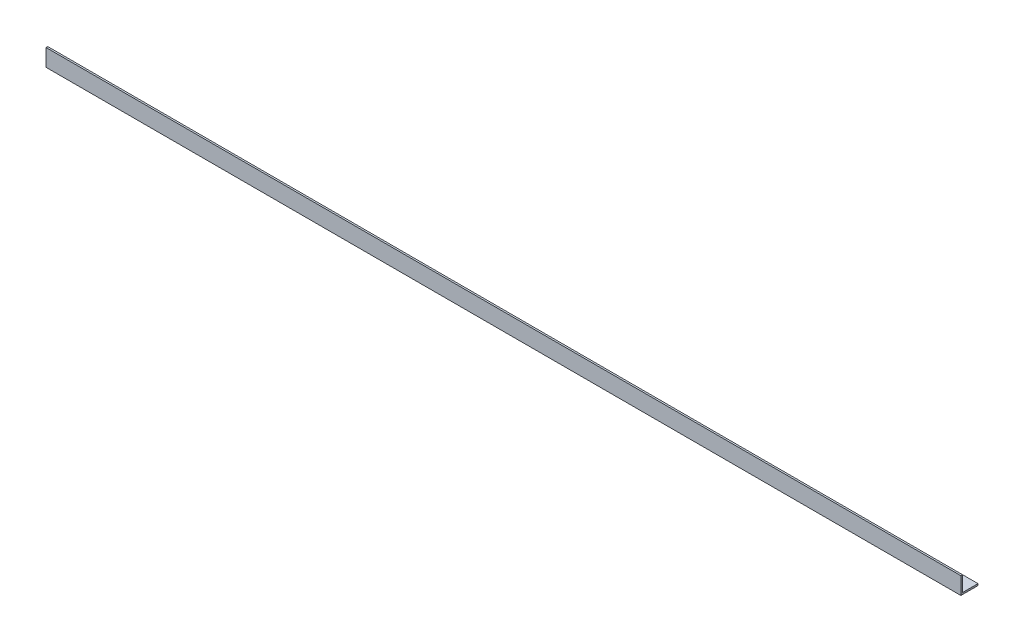
ISO-10303-21;
HEADER;
FILE_DESCRIPTION(('STEP AP214'),'2;1');
FILE_NAME('part.step','',(''),(''),'','','');
FILE_SCHEMA(('AUTOMOTIVE_DESIGN { 1 0 10303 214 1 1 1 1 }'));
ENDSEC;
DATA;
#1=APPLICATION_CONTEXT('core data for automotive mechanical design processes');
#2=APPLICATION_PROTOCOL_DEFINITION('international standard','automotive_design',2000,#1);
#3=PRODUCT_CONTEXT('',#1,'mechanical');
#4=PRODUCT('Part','Part','',(#3));
#5=PRODUCT_RELATED_PRODUCT_CATEGORY('part','',(#4));
#6=PRODUCT_DEFINITION_FORMATION('','',#4);
#7=PRODUCT_DEFINITION_CONTEXT('part definition',#1,'design');
#8=PRODUCT_DEFINITION('design','',#6,#7);
#9=PRODUCT_DEFINITION_SHAPE('','',#8);
#10=(LENGTH_UNIT() NAMED_UNIT(*) SI_UNIT(.MILLI.,.METRE.));
#11=(NAMED_UNIT(*) PLANE_ANGLE_UNIT() SI_UNIT($,.RADIAN.));
#12=(NAMED_UNIT(*) SI_UNIT($,.STERADIAN.) SOLID_ANGLE_UNIT());
#13=UNCERTAINTY_MEASURE_WITH_UNIT(LENGTH_MEASURE(1.E-05),#10,'distance_accuracy_value','');
#14=(GEOMETRIC_REPRESENTATION_CONTEXT(3) GLOBAL_UNCERTAINTY_ASSIGNED_CONTEXT((#13)) GLOBAL_UNIT_ASSIGNED_CONTEXT((#10,
#11,#12)) REPRESENTATION_CONTEXT('',''));
#15=CARTESIAN_POINT('',(0.,0.,0.));
#16=DIRECTION('',(0.,0.,1.));
#17=DIRECTION('',(1.,0.,0.));
#18=AXIS2_PLACEMENT_3D('',#15,#16,#17);
#19=CARTESIAN_POINT('',(2665.,0.,0.));
#20=DIRECTION('',(0.,1.,0.));
#21=DIRECTION('',(0.,0.,1.));
#22=AXIS2_PLACEMENT_3D('',#19,#20,#21);
#23=PLANE('',#22);
#24=DIRECTION('',(0.,0.,-1.));
#25=VECTOR('',#24,1.);
#26=CARTESIAN_POINT('',(0.,0.,0.));
#27=LINE('',#26,#25);
#28=CARTESIAN_POINT('',(0.,0.,0.));
#29=VERTEX_POINT('',#28);
#30=CARTESIAN_POINT('',(0.,0.,-50.));
#31=VERTEX_POINT('',#30);
#32=EDGE_CURVE('E121',#29,#31,#27,.T.);
#33=ORIENTED_EDGE('',*,*,#32,.T.);
#34=DIRECTION('',(-1.,0.,0.));
#35=VECTOR('',#34,1.);
#36=CARTESIAN_POINT('',(2665.,0.,-50.));
#37=LINE('',#36,#35);
#38=CARTESIAN_POINT('',(2665.,0.,-50.));
#39=VERTEX_POINT('',#38);
#40=EDGE_CURVE('E11',#39,#31,#37,.T.);
#41=ORIENTED_EDGE('',*,*,#40,.F.);
#42=DIRECTION('',(0.,0.,-1.));
#43=VECTOR('',#42,1.);
#44=CARTESIAN_POINT('',(2665.,0.,0.));
#45=LINE('',#44,#43);
#46=CARTESIAN_POINT('',(2665.,0.,0.));
#47=VERTEX_POINT('',#46);
#48=EDGE_CURVE('E85',#47,#39,#45,.T.);
#49=ORIENTED_EDGE('',*,*,#48,.F.);
#50=DIRECTION('',(-1.,0.,0.));
#51=VECTOR('',#50,1.);
#52=CARTESIAN_POINT('',(2665.,0.,0.));
#53=LINE('',#52,#51);
#54=EDGE_CURVE('E117',#47,#29,#53,.T.);
#55=ORIENTED_EDGE('',*,*,#54,.T.);
#56=EDGE_LOOP('',(#33,#41,#49,#55));
#57=FACE_BOUND('',#56,.T.);
#58=ADVANCED_FACE('F38',(#57),#23,.F.);
#59=CARTESIAN_POINT('',(2665.,5.,-50.));
#60=DIRECTION('',(0.,0.,-1.));
#61=DIRECTION('',(-1.,0.,0.));
#62=AXIS2_PLACEMENT_3D('',#59,#60,#61);
#63=PLANE('',#62);
#64=DIRECTION('',(0.,-1.,0.));
#65=VECTOR('',#64,1.);
#66=CARTESIAN_POINT('',(0.,5.,-50.));
#67=LINE('',#66,#65);
#68=CARTESIAN_POINT('',(0.,5.,-50.));
#69=VERTEX_POINT('',#68);
#70=EDGE_CURVE('E124',#69,#31,#67,.T.);
#71=ORIENTED_EDGE('',*,*,#70,.F.);
#72=DIRECTION('',(-1.,0.,0.));
#73=VECTOR('',#72,1.);
#74=CARTESIAN_POINT('',(2665.,5.,-50.));
#75=LINE('',#74,#73);
#76=CARTESIAN_POINT('',(2665.,5.,-50.));
#77=VERTEX_POINT('',#76);
#78=EDGE_CURVE('E47',#77,#69,#75,.T.);
#79=ORIENTED_EDGE('',*,*,#78,.F.);
#80=DIRECTION('',(0.,-1.,0.));
#81=VECTOR('',#80,1.);
#82=CARTESIAN_POINT('',(2665.,5.,-50.));
#83=LINE('',#82,#81);
#84=EDGE_CURVE('E216',#77,#39,#83,.T.);
#85=ORIENTED_EDGE('',*,*,#84,.T.);
#86=ORIENTED_EDGE('',*,*,#40,.T.);
#87=EDGE_LOOP('',(#71,#79,#85,#86));
#88=FACE_BOUND('',#87,.T.);
#89=ADVANCED_FACE('F146',(#88),#63,.T.);
#90=CARTESIAN_POINT('',(2665.,5.,0.));
#91=DIRECTION('',(0.,1.,0.));
#92=DIRECTION('',(0.,0.,1.));
#93=AXIS2_PLACEMENT_3D('',#90,#91,#92);
#94=PLANE('',#93);
#95=DIRECTION('',(0.,0.,-1.));
#96=VECTOR('',#95,1.);
#97=CARTESIAN_POINT('',(0.,5.,0.));
#98=LINE('',#97,#96);
#99=CARTESIAN_POINT('',(0.,5.,-5.));
#100=VERTEX_POINT('',#99);
#101=EDGE_CURVE('E127',#100,#69,#98,.T.);
#102=ORIENTED_EDGE('',*,*,#101,.F.);
#103=DIRECTION('',(-1.,0.,0.));
#104=VECTOR('',#103,1.);
#105=CARTESIAN_POINT('',(2665.,5.,-5.));
#106=LINE('',#105,#104);
#107=CARTESIAN_POINT('',(2665.,5.,-5.));
#108=VERTEX_POINT('',#107);
#109=EDGE_CURVE('E107',#108,#100,#106,.T.);
#110=ORIENTED_EDGE('',*,*,#109,.F.);
#111=DIRECTION('',(0.,0.,-1.));
#112=VECTOR('',#111,1.);
#113=CARTESIAN_POINT('',(2665.,5.,0.));
#114=LINE('',#113,#112);
#115=EDGE_CURVE('E113',#108,#77,#114,.T.);
#116=ORIENTED_EDGE('',*,*,#115,.T.);
#117=ORIENTED_EDGE('',*,*,#78,.T.);
#118=EDGE_LOOP('',(#102,#110,#116,#117));
#119=FACE_BOUND('',#118,.T.);
#120=ADVANCED_FACE('F143',(#119),#94,.T.);
#121=CARTESIAN_POINT('',(2665.,50.,-5.));
#122=DIRECTION('',(0.,0.,-1.));
#123=DIRECTION('',(0.,1.,0.));
#124=AXIS2_PLACEMENT_3D('',#121,#122,#123);
#125=PLANE('',#124);
#126=DIRECTION('',(0.,-1.,0.));
#127=VECTOR('',#126,1.);
#128=CARTESIAN_POINT('',(0.,50.,-5.));
#129=LINE('',#128,#127);
#130=CARTESIAN_POINT('',(0.,50.,-5.));
#131=VERTEX_POINT('',#130);
#132=EDGE_CURVE('E101',#131,#100,#129,.T.);
#133=ORIENTED_EDGE('',*,*,#132,.F.);
#134=DIRECTION('',(-1.,0.,0.));
#135=VECTOR('',#134,1.);
#136=CARTESIAN_POINT('',(2665.,50.,-5.));
#137=LINE('',#136,#135);
#138=CARTESIAN_POINT('',(2665.,50.,-5.));
#139=VERTEX_POINT('',#138);
#140=EDGE_CURVE('E96',#139,#131,#137,.T.);
#141=ORIENTED_EDGE('',*,*,#140,.F.);
#142=DIRECTION('',(0.,-1.,0.));
#143=VECTOR('',#142,1.);
#144=CARTESIAN_POINT('',(2665.,50.,-5.));
#145=LINE('',#144,#143);
#146=EDGE_CURVE('E99',#139,#108,#145,.T.);
#147=ORIENTED_EDGE('',*,*,#146,.T.);
#148=ORIENTED_EDGE('',*,*,#109,.T.);
#149=EDGE_LOOP('',(#133,#141,#147,#148));
#150=FACE_BOUND('',#149,.T.);
#151=ADVANCED_FACE('F98',(#150),#125,.T.);
#152=CARTESIAN_POINT('',(2665.,50.,0.));
#153=DIRECTION('',(0.,1.,0.));
#154=DIRECTION('',(0.,0.,1.));
#155=AXIS2_PLACEMENT_3D('',#152,#153,#154);
#156=PLANE('',#155);
#157=DIRECTION('',(0.,0.,-1.));
#158=VECTOR('',#157,1.);
#159=CARTESIAN_POINT('',(0.,50.,0.));
#160=LINE('',#159,#158);
#161=CARTESIAN_POINT('',(0.,50.,0.));
#162=VERTEX_POINT('',#161);
#163=EDGE_CURVE('E131',#162,#131,#160,.T.);
#164=ORIENTED_EDGE('',*,*,#163,.F.);
#165=DIRECTION('',(-1.,0.,0.));
#166=VECTOR('',#165,1.);
#167=CARTESIAN_POINT('',(2665.,50.,0.));
#168=LINE('',#167,#166);
#169=CARTESIAN_POINT('',(2665.,50.,0.));
#170=VERTEX_POINT('',#169);
#171=EDGE_CURVE('E76',#170,#162,#168,.T.);
#172=ORIENTED_EDGE('',*,*,#171,.F.);
#173=DIRECTION('',(0.,0.,-1.));
#174=VECTOR('',#173,1.);
#175=CARTESIAN_POINT('',(2665.,50.,0.));
#176=LINE('',#175,#174);
#177=EDGE_CURVE('E111',#170,#139,#176,.T.);
#178=ORIENTED_EDGE('',*,*,#177,.T.);
#179=ORIENTED_EDGE('',*,*,#140,.T.);
#180=EDGE_LOOP('',(#164,#172,#178,#179));
#181=FACE_BOUND('',#180,.T.);
#182=ADVANCED_FACE('F115',(#181),#156,.T.);
#183=CARTESIAN_POINT('',(2665.,50.,0.));
#184=DIRECTION('',(0.,0.,-1.));
#185=DIRECTION('',(0.,1.,0.));
#186=AXIS2_PLACEMENT_3D('',#183,#184,#185);
#187=PLANE('',#186);
#188=DIRECTION('',(0.,-1.,0.));
#189=VECTOR('',#188,1.);
#190=CARTESIAN_POINT('',(0.,50.,0.));
#191=LINE('',#190,#189);
#192=EDGE_CURVE('E79',#162,#29,#191,.T.);
#193=ORIENTED_EDGE('',*,*,#192,.T.);
#194=ORIENTED_EDGE('',*,*,#54,.F.);
#195=DIRECTION('',(0.,-1.,0.));
#196=VECTOR('',#195,1.);
#197=CARTESIAN_POINT('',(2665.,50.,0.));
#198=LINE('',#197,#196);
#199=EDGE_CURVE('E55',#170,#47,#198,.T.);
#200=ORIENTED_EDGE('',*,*,#199,.F.);
#201=ORIENTED_EDGE('',*,*,#171,.T.);
#202=EDGE_LOOP('',(#193,#194,#200,#201));
#203=FACE_BOUND('',#202,.T.);
#204=ADVANCED_FACE('F151',(#203),#187,.F.);
#205=CARTESIAN_POINT('',(2665.,0.,0.));
#206=DIRECTION('',(-1.,0.,0.));
#207=DIRECTION('',(0.,0.,1.));
#208=AXIS2_PLACEMENT_3D('',#205,#206,#207);
#209=PLANE('',#208);
#210=ORIENTED_EDGE('',*,*,#48,.T.);
#211=ORIENTED_EDGE('',*,*,#84,.F.);
#212=ORIENTED_EDGE('',*,*,#115,.F.);
#213=ORIENTED_EDGE('',*,*,#146,.F.);
#214=ORIENTED_EDGE('',*,*,#177,.F.);
#215=ORIENTED_EDGE('',*,*,#199,.T.);
#216=EDGE_LOOP('',(#210,#211,#212,#213,#214,#215));
#217=FACE_BOUND('',#216,.T.);
#218=ADVANCED_FACE('F110',(#217),#209,.F.);
#219=CARTESIAN_POINT('',(0.,0.,0.));
#220=DIRECTION('',(-1.,0.,0.));
#221=DIRECTION('',(0.,0.,1.));
#222=AXIS2_PLACEMENT_3D('',#219,#220,#221);
#223=PLANE('',#222);
#224=ORIENTED_EDGE('',*,*,#32,.F.);
#225=ORIENTED_EDGE('',*,*,#192,.F.);
#226=ORIENTED_EDGE('',*,*,#163,.T.);
#227=ORIENTED_EDGE('',*,*,#132,.T.);
#228=ORIENTED_EDGE('',*,*,#101,.T.);
#229=ORIENTED_EDGE('',*,*,#70,.T.);
#230=EDGE_LOOP('',(#224,#225,#226,#227,#228,#229));
#231=FACE_BOUND('',#230,.T.);
#232=ADVANCED_FACE('F149',(#231),#223,.T.);
#233=CLOSED_SHELL('',(#58,#89,#120,#151,#182,#204,#218,#232));
#234=MANIFOLD_SOLID_BREP('B2',#233);
#235=ADVANCED_BREP_SHAPE_REPRESENTATION('',(#18,#234),#14);
#236=SHAPE_DEFINITION_REPRESENTATION(#9,#235);
ENDSEC;
END-ISO-10303-21;
